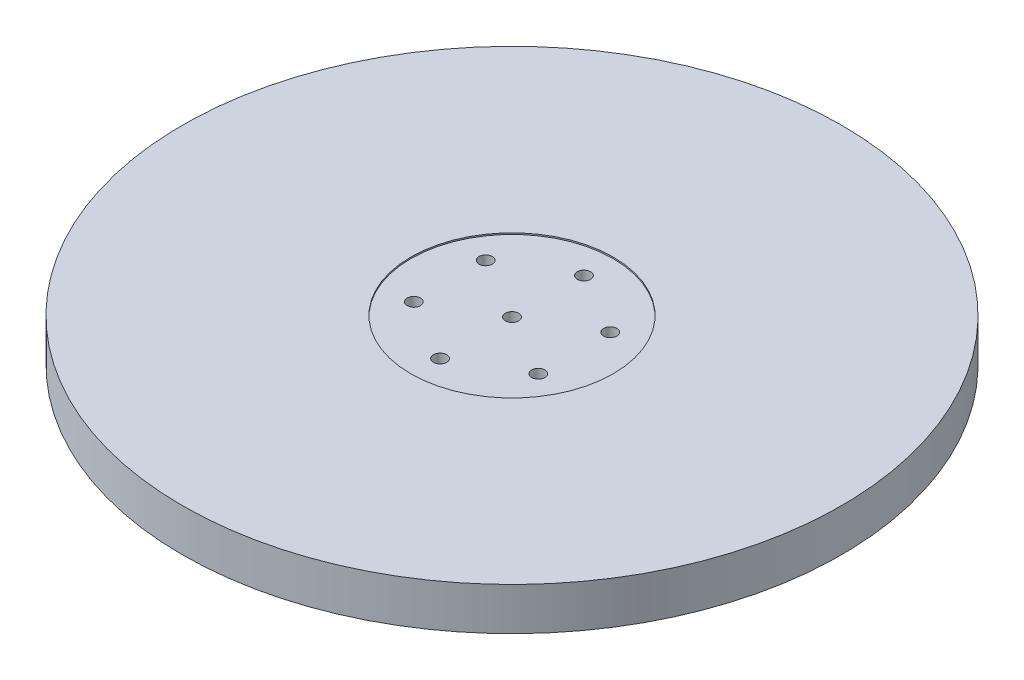
ISO-10303-21;
HEADER;
FILE_DESCRIPTION(('STEP AP214'),'2;1');
FILE_NAME('part.step','',(''),(''),'','','');
FILE_SCHEMA(('AUTOMOTIVE_DESIGN { 1 0 10303 214 1 1 1 1 }'));
ENDSEC;
DATA;
#1=APPLICATION_CONTEXT('core data for automotive mechanical design processes');
#2=APPLICATION_PROTOCOL_DEFINITION('international standard','automotive_design',2000,#1);
#3=PRODUCT_CONTEXT('',#1,'mechanical');
#4=PRODUCT('Part','Part','',(#3));
#5=PRODUCT_RELATED_PRODUCT_CATEGORY('part','',(#4));
#6=PRODUCT_DEFINITION_FORMATION('','',#4);
#7=PRODUCT_DEFINITION_CONTEXT('part definition',#1,'design');
#8=PRODUCT_DEFINITION('design','',#6,#7);
#9=PRODUCT_DEFINITION_SHAPE('','',#8);
#10=(LENGTH_UNIT() NAMED_UNIT(*) SI_UNIT(.MILLI.,.METRE.));
#11=(NAMED_UNIT(*) PLANE_ANGLE_UNIT() SI_UNIT($,.RADIAN.));
#12=(NAMED_UNIT(*) SI_UNIT($,.STERADIAN.) SOLID_ANGLE_UNIT());
#13=UNCERTAINTY_MEASURE_WITH_UNIT(LENGTH_MEASURE(1.E-05),#10,'distance_accuracy_value','');
#14=(GEOMETRIC_REPRESENTATION_CONTEXT(3) GLOBAL_UNCERTAINTY_ASSIGNED_CONTEXT((#13)) GLOBAL_UNIT_ASSIGNED_CONTEXT((#10,
#11,#12)) REPRESENTATION_CONTEXT('',''));
#15=CARTESIAN_POINT('',(0.,0.,0.));
#16=DIRECTION('',(0.,0.,1.));
#17=DIRECTION('',(1.,0.,0.));
#18=AXIS2_PLACEMENT_3D('',#15,#16,#17);
#19=CARTESIAN_POINT('',(11.6913429510903,4.,-6.75000000000069));
#20=DIRECTION('',(0.,1.,0.));
#21=DIRECTION('',(0.,0.,1.));
#22=AXIS2_PLACEMENT_3D('',#19,#20,#21);
#23=CYLINDRICAL_SURFACE('',#22,1.25);
#24=CARTESIAN_POINT('',(11.6913429510903,4.,-6.75000000000069));
#25=DIRECTION('',(0.,1.,0.));
#26=DIRECTION('',(0.,0.,1.));
#27=AXIS2_PLACEMENT_3D('',#24,#25,#26);
#28=CIRCLE('',#27,1.25);
#29=CARTESIAN_POINT('',(11.6913429510903,4.,-5.50000000000069));
#30=VERTEX_POINT('',#29);
#31=EDGE_CURVE('E65',#30,#30,#28,.T.);
#32=ORIENTED_EDGE('',*,*,#31,.F.);
#33=EDGE_LOOP('',(#32));
#34=FACE_BOUND('',#33,.T.);
#35=CARTESIAN_POINT('',(11.6913429510903,7.7361,-6.75000000000069));
#36=DIRECTION('',(0.,1.,0.));
#37=DIRECTION('',(0.,0.,1.));
#38=AXIS2_PLACEMENT_3D('',#35,#36,#37);
#39=CIRCLE('',#38,1.25);
#40=CARTESIAN_POINT('',(11.6913429510903,7.7361,-5.50000000000069));
#41=VERTEX_POINT('',#40);
#42=EDGE_CURVE('E97',#41,#41,#39,.F.);
#43=ORIENTED_EDGE('',*,*,#42,.F.);
#44=EDGE_LOOP('',(#43));
#45=FACE_BOUND('',#44,.T.);
#46=ADVANCED_FACE('F41',(#34,#45),#23,.F.);
#47=CARTESIAN_POINT('',(0.,4.,-13.5));
#48=DIRECTION('',(0.,1.,0.));
#49=DIRECTION('',(0.,0.,1.));
#50=AXIS2_PLACEMENT_3D('',#47,#48,#49);
#51=CYLINDRICAL_SURFACE('',#50,1.25);
#52=CARTESIAN_POINT('',(0.,4.,-13.5));
#53=DIRECTION('',(0.,1.,0.));
#54=DIRECTION('',(0.,0.,1.));
#55=AXIS2_PLACEMENT_3D('',#52,#53,#54);
#56=CIRCLE('',#55,1.25);
#57=CARTESIAN_POINT('',(0.,4.,-12.25));
#58=VERTEX_POINT('',#57);
#59=EDGE_CURVE('E69',#58,#58,#56,.T.);
#60=ORIENTED_EDGE('',*,*,#59,.F.);
#61=EDGE_LOOP('',(#60));
#62=FACE_BOUND('',#61,.T.);
#63=CARTESIAN_POINT('',(0.,7.7361,-13.5));
#64=DIRECTION('',(0.,1.,0.));
#65=DIRECTION('',(0.,0.,1.));
#66=AXIS2_PLACEMENT_3D('',#63,#64,#65);
#67=CIRCLE('',#66,1.25);
#68=CARTESIAN_POINT('',(0.,7.7361,-12.25));
#69=VERTEX_POINT('',#68);
#70=EDGE_CURVE('E101',#69,#69,#67,.F.);
#71=ORIENTED_EDGE('',*,*,#70,.F.);
#72=EDGE_LOOP('',(#71));
#73=FACE_BOUND('',#72,.T.);
#74=ADVANCED_FACE('F152',(#62,#73),#51,.F.);
#75=CARTESIAN_POINT('',(-11.6913429510895,4.,-6.74999999999931));
#76=DIRECTION('',(0.,1.,0.));
#77=DIRECTION('',(0.,0.,1.));
#78=AXIS2_PLACEMENT_3D('',#75,#76,#77);
#79=CYLINDRICAL_SURFACE('',#78,1.25);
#80=CARTESIAN_POINT('',(-11.6913429510895,4.,-6.74999999999931));
#81=DIRECTION('',(0.,1.,0.));
#82=DIRECTION('',(0.,0.,1.));
#83=AXIS2_PLACEMENT_3D('',#80,#81,#82);
#84=CIRCLE('',#83,1.25);
#85=CARTESIAN_POINT('',(-11.6913429510895,4.,-5.49999999999931));
#86=VERTEX_POINT('',#85);
#87=EDGE_CURVE('E83',#86,#86,#84,.T.);
#88=ORIENTED_EDGE('',*,*,#87,.F.);
#89=EDGE_LOOP('',(#88));
#90=FACE_BOUND('',#89,.T.);
#91=CARTESIAN_POINT('',(-11.6913429510895,7.7361,-6.74999999999931));
#92=DIRECTION('',(0.,1.,0.));
#93=DIRECTION('',(0.,0.,1.));
#94=AXIS2_PLACEMENT_3D('',#91,#92,#93);
#95=CIRCLE('',#94,1.25);
#96=CARTESIAN_POINT('',(-11.6913429510895,7.7361,-5.49999999999931));
#97=VERTEX_POINT('',#96);
#98=EDGE_CURVE('E105',#97,#97,#95,.F.);
#99=ORIENTED_EDGE('',*,*,#98,.F.);
#100=EDGE_LOOP('',(#99));
#101=FACE_BOUND('',#100,.T.);
#102=ADVANCED_FACE('F159',(#90,#101),#79,.F.);
#103=CARTESIAN_POINT('',(-11.6913429510887,4.,6.75000000000069));
#104=DIRECTION('',(0.,1.,0.));
#105=DIRECTION('',(0.,0.,1.));
#106=AXIS2_PLACEMENT_3D('',#103,#104,#105);
#107=CYLINDRICAL_SURFACE('',#106,1.25);
#108=CARTESIAN_POINT('',(-11.6913429510887,4.,6.75000000000069));
#109=DIRECTION('',(0.,1.,0.));
#110=DIRECTION('',(0.,0.,1.));
#111=AXIS2_PLACEMENT_3D('',#108,#109,#110);
#112=CIRCLE('',#111,1.25);
#113=CARTESIAN_POINT('',(-11.6913429510887,4.,8.00000000000069));
#114=VERTEX_POINT('',#113);
#115=EDGE_CURVE('E79',#114,#114,#112,.T.);
#116=ORIENTED_EDGE('',*,*,#115,.F.);
#117=EDGE_LOOP('',(#116));
#118=FACE_BOUND('',#117,.T.);
#119=CARTESIAN_POINT('',(-11.6913429510887,7.7361,6.75000000000069));
#120=DIRECTION('',(0.,1.,0.));
#121=DIRECTION('',(0.,0.,1.));
#122=AXIS2_PLACEMENT_3D('',#119,#120,#121);
#123=CIRCLE('',#122,1.25);
#124=CARTESIAN_POINT('',(-11.6913429510887,7.7361,8.00000000000069));
#125=VERTEX_POINT('',#124);
#126=EDGE_CURVE('E109',#125,#125,#123,.F.);
#127=ORIENTED_EDGE('',*,*,#126,.F.);
#128=EDGE_LOOP('',(#127));
#129=FACE_BOUND('',#128,.T.);
#130=ADVANCED_FACE('F233',(#118,#129),#107,.F.);
#131=CARTESIAN_POINT('',(0.,4.,13.5));
#132=DIRECTION('',(0.,1.,0.));
#133=DIRECTION('',(0.,0.,1.));
#134=AXIS2_PLACEMENT_3D('',#131,#132,#133);
#135=CYLINDRICAL_SURFACE('',#134,1.25);
#136=CARTESIAN_POINT('',(0.,4.,13.5));
#137=DIRECTION('',(0.,1.,0.));
#138=DIRECTION('',(0.,0.,1.));
#139=AXIS2_PLACEMENT_3D('',#136,#137,#138);
#140=CIRCLE('',#139,1.25);
#141=CARTESIAN_POINT('',(0.,4.,14.75));
#142=VERTEX_POINT('',#141);
#143=EDGE_CURVE('E74',#142,#142,#140,.T.);
#144=ORIENTED_EDGE('',*,*,#143,.F.);
#145=EDGE_LOOP('',(#144));
#146=FACE_BOUND('',#145,.T.);
#147=CARTESIAN_POINT('',(0.,7.7361,13.5));
#148=DIRECTION('',(0.,1.,0.));
#149=DIRECTION('',(0.,0.,1.));
#150=AXIS2_PLACEMENT_3D('',#147,#148,#149);
#151=CIRCLE('',#150,1.25);
#152=CARTESIAN_POINT('',(0.,7.7361,14.75));
#153=VERTEX_POINT('',#152);
#154=EDGE_CURVE('E113',#153,#153,#151,.F.);
#155=ORIENTED_EDGE('',*,*,#154,.F.);
#156=EDGE_LOOP('',(#155));
#157=FACE_BOUND('',#156,.T.);
#158=ADVANCED_FACE('F145',(#146,#157),#135,.F.);
#159=CARTESIAN_POINT('',(11.6913429510911,4.,6.74999999999931));
#160=DIRECTION('',(0.,1.,0.));
#161=DIRECTION('',(0.,0.,1.));
#162=AXIS2_PLACEMENT_3D('',#159,#160,#161);
#163=CYLINDRICAL_SURFACE('',#162,1.25);
#164=CARTESIAN_POINT('',(11.6913429510911,4.,6.74999999999931));
#165=DIRECTION('',(0.,1.,0.));
#166=DIRECTION('',(0.,0.,1.));
#167=AXIS2_PLACEMENT_3D('',#164,#165,#166);
#168=CIRCLE('',#167,1.25);
#169=CARTESIAN_POINT('',(11.6913429510911,4.,7.99999999999931));
#170=VERTEX_POINT('',#169);
#171=EDGE_CURVE('E70',#170,#170,#168,.T.);
#172=ORIENTED_EDGE('',*,*,#171,.F.);
#173=EDGE_LOOP('',(#172));
#174=FACE_BOUND('',#173,.T.);
#175=CARTESIAN_POINT('',(11.6913429510911,7.7361,6.74999999999931));
#176=DIRECTION('',(0.,1.,0.));
#177=DIRECTION('',(0.,0.,1.));
#178=AXIS2_PLACEMENT_3D('',#175,#176,#177);
#179=CIRCLE('',#178,1.25);
#180=CARTESIAN_POINT('',(11.6913429510911,7.7361,7.99999999999931));
#181=VERTEX_POINT('',#180);
#182=EDGE_CURVE('E117',#181,#181,#179,.F.);
#183=ORIENTED_EDGE('',*,*,#182,.F.);
#184=EDGE_LOOP('',(#183));
#185=FACE_BOUND('',#184,.T.);
#186=ADVANCED_FACE('F136',(#174,#185),#163,.F.);
#187=CARTESIAN_POINT('',(0.,4.,0.));
#188=DIRECTION('',(0.,1.,0.));
#189=DIRECTION('',(0.,0.,1.));
#190=AXIS2_PLACEMENT_3D('',#187,#188,#189);
#191=CYLINDRICAL_SURFACE('',#190,1.25);
#192=CARTESIAN_POINT('',(0.,4.,0.));
#193=DIRECTION('',(0.,1.,0.));
#194=DIRECTION('',(0.,0.,1.));
#195=AXIS2_PLACEMENT_3D('',#192,#193,#194);
#196=CIRCLE('',#195,1.25);
#197=CARTESIAN_POINT('',(0.,4.,1.25));
#198=VERTEX_POINT('',#197);
#199=EDGE_CURVE('E75',#198,#198,#196,.T.);
#200=ORIENTED_EDGE('',*,*,#199,.F.);
#201=EDGE_LOOP('',(#200));
#202=FACE_BOUND('',#201,.T.);
#203=CARTESIAN_POINT('',(0.,7.7361,0.));
#204=DIRECTION('',(0.,1.,0.));
#205=DIRECTION('',(0.,0.,1.));
#206=AXIS2_PLACEMENT_3D('',#203,#204,#205);
#207=CIRCLE('',#206,1.25);
#208=CARTESIAN_POINT('',(0.,7.7361,1.25));
#209=VERTEX_POINT('',#208);
#210=EDGE_CURVE('E45',#209,#209,#207,.F.);
#211=ORIENTED_EDGE('',*,*,#210,.F.);
#212=EDGE_LOOP('',(#211));
#213=FACE_BOUND('',#212,.T.);
#214=ADVANCED_FACE('F133',(#202,#213),#191,.F.);
#215=CARTESIAN_POINT('',(0.,0.,0.));
#216=DIRECTION('',(0.,1.,0.));
#217=DIRECTION('',(0.,0.,1.));
#218=AXIS2_PLACEMENT_3D('',#215,#216,#217);
#219=CYLINDRICAL_SURFACE('',#218,20.);
#220=CARTESIAN_POINT('',(0.,0.,0.));
#221=DIRECTION('',(0.,1.,0.));
#222=DIRECTION('',(0.,0.,1.));
#223=AXIS2_PLACEMENT_3D('',#220,#221,#222);
#224=CIRCLE('',#223,20.);
#225=CARTESIAN_POINT('',(0.,0.,20.));
#226=VERTEX_POINT('',#225);
#227=EDGE_CURVE('E60',#226,#226,#224,.T.);
#228=ORIENTED_EDGE('',*,*,#227,.F.);
#229=EDGE_LOOP('',(#228));
#230=FACE_BOUND('',#229,.T.);
#231=CARTESIAN_POINT('',(0.,4.,0.));
#232=DIRECTION('',(0.,1.,0.));
#233=DIRECTION('',(0.,0.,1.));
#234=AXIS2_PLACEMENT_3D('',#231,#232,#233);
#235=CIRCLE('',#234,20.);
#236=CARTESIAN_POINT('',(0.,4.,20.));
#237=VERTEX_POINT('',#236);
#238=EDGE_CURVE('E10',#237,#237,#235,.F.);
#239=ORIENTED_EDGE('',*,*,#238,.F.);
#240=EDGE_LOOP('',(#239));
#241=FACE_BOUND('',#240,.T.);
#242=ADVANCED_FACE('F135',(#230,#241),#219,.F.);
#243=CARTESIAN_POINT('',(0.,8.,0.));
#244=DIRECTION('',(0.,-1.,0.));
#245=DIRECTION('',(0.,0.,-1.));
#246=AXIS2_PLACEMENT_3D('',#243,#244,#245);
#247=CYLINDRICAL_SURFACE('',#246,61.885645);
#248=CARTESIAN_POINT('',(0.,8.,0.));
#249=DIRECTION('',(0.,1.,0.));
#250=DIRECTION('',(0.,0.,1.));
#251=AXIS2_PLACEMENT_3D('',#248,#249,#250);
#252=CIRCLE('',#251,61.885645);
#253=CARTESIAN_POINT('',(0.,8.,61.885645));
#254=VERTEX_POINT('',#253);
#255=EDGE_CURVE('E50',#254,#254,#252,.T.);
#256=ORIENTED_EDGE('',*,*,#255,.F.);
#257=EDGE_LOOP('',(#256));
#258=FACE_BOUND('',#257,.T.);
#259=CARTESIAN_POINT('',(0.,0.,0.));
#260=DIRECTION('',(0.,1.,0.));
#261=DIRECTION('',(0.,0.,1.));
#262=AXIS2_PLACEMENT_3D('',#259,#260,#261);
#263=CIRCLE('',#262,61.885645);
#264=CARTESIAN_POINT('',(0.,0.,61.885645));
#265=VERTEX_POINT('',#264);
#266=EDGE_CURVE('E55',#265,#265,#263,.T.);
#267=ORIENTED_EDGE('',*,*,#266,.T.);
#268=EDGE_LOOP('',(#267));
#269=FACE_BOUND('',#268,.T.);
#270=ADVANCED_FACE('F43',(#258,#269),#247,.T.);
#271=CARTESIAN_POINT('',(0.,8.,0.));
#272=DIRECTION('',(0.,1.,0.));
#273=DIRECTION('',(0.,0.,1.));
#274=AXIS2_PLACEMENT_3D('',#271,#272,#273);
#275=PLANE('',#274);
#276=CARTESIAN_POINT('',(0.,8.,0.));
#277=DIRECTION('',(0.,1.,0.));
#278=DIRECTION('',(0.,0.,1.));
#279=AXIS2_PLACEMENT_3D('',#276,#277,#278);
#280=CIRCLE('',#279,19.);
#281=CARTESIAN_POINT('',(0.,8.,19.));
#282=VERTEX_POINT('',#281);
#283=EDGE_CURVE('E93',#282,#282,#280,.T.);
#284=ORIENTED_EDGE('',*,*,#283,.F.);
#285=EDGE_LOOP('',(#284));
#286=FACE_BOUND('',#285,.T.);
#287=ORIENTED_EDGE('',*,*,#255,.T.);
#288=EDGE_LOOP('',(#287));
#289=FACE_BOUND('',#288,.T.);
#290=ADVANCED_FACE('F170',(#286,#289),#275,.T.);
#291=CARTESIAN_POINT('',(0.,0.,0.));
#292=DIRECTION('',(0.,1.,0.));
#293=DIRECTION('',(0.,0.,1.));
#294=AXIS2_PLACEMENT_3D('',#291,#292,#293);
#295=PLANE('',#294);
#296=ORIENTED_EDGE('',*,*,#227,.T.);
#297=EDGE_LOOP('',(#296));
#298=FACE_BOUND('',#297,.T.);
#299=ORIENTED_EDGE('',*,*,#266,.F.);
#300=EDGE_LOOP('',(#299));
#301=FACE_BOUND('',#300,.T.);
#302=ADVANCED_FACE('F167',(#298,#301),#295,.F.);
#303=CARTESIAN_POINT('',(0.,4.,0.));
#304=DIRECTION('',(0.,1.,0.));
#305=DIRECTION('',(0.,0.,1.));
#306=AXIS2_PLACEMENT_3D('',#303,#304,#305);
#307=PLANE('',#306);
#308=ORIENTED_EDGE('',*,*,#199,.T.);
#309=EDGE_LOOP('',(#308));
#310=FACE_BOUND('',#309,.T.);
#311=ORIENTED_EDGE('',*,*,#171,.T.);
#312=EDGE_LOOP('',(#311));
#313=FACE_BOUND('',#312,.T.);
#314=ORIENTED_EDGE('',*,*,#143,.T.);
#315=EDGE_LOOP('',(#314));
#316=FACE_BOUND('',#315,.T.);
#317=ORIENTED_EDGE('',*,*,#115,.T.);
#318=EDGE_LOOP('',(#317));
#319=FACE_BOUND('',#318,.T.);
#320=ORIENTED_EDGE('',*,*,#87,.T.);
#321=EDGE_LOOP('',(#320));
#322=FACE_BOUND('',#321,.T.);
#323=ORIENTED_EDGE('',*,*,#59,.T.);
#324=EDGE_LOOP('',(#323));
#325=FACE_BOUND('',#324,.T.);
#326=ORIENTED_EDGE('',*,*,#31,.T.);
#327=EDGE_LOOP('',(#326));
#328=FACE_BOUND('',#327,.T.);
#329=ORIENTED_EDGE('',*,*,#238,.T.);
#330=EDGE_LOOP('',(#329));
#331=FACE_BOUND('',#330,.T.);
#332=ADVANCED_FACE('F165',(#310,#313,#316,#319,#322,#325,#328,#331),#307,.F.);
#333=CARTESIAN_POINT('',(0.,7.7361,0.));
#334=DIRECTION('',(0.,1.,0.));
#335=DIRECTION('',(0.,0.,1.));
#336=AXIS2_PLACEMENT_3D('',#333,#334,#335);
#337=PLANE('',#336);
#338=CARTESIAN_POINT('',(0.,7.7361,0.));
#339=DIRECTION('',(0.,1.,0.));
#340=DIRECTION('',(0.,0.,1.));
#341=AXIS2_PLACEMENT_3D('',#338,#339,#340);
#342=CIRCLE('',#341,19.);
#343=CARTESIAN_POINT('',(0.,7.7361,19.));
#344=VERTEX_POINT('',#343);
#345=EDGE_CURVE('E121',#344,#344,#342,.T.);
#346=ORIENTED_EDGE('',*,*,#345,.T.);
#347=EDGE_LOOP('',(#346));
#348=FACE_BOUND('',#347,.T.);
#349=ORIENTED_EDGE('',*,*,#210,.T.);
#350=EDGE_LOOP('',(#349));
#351=FACE_BOUND('',#350,.T.);
#352=ORIENTED_EDGE('',*,*,#182,.T.);
#353=EDGE_LOOP('',(#352));
#354=FACE_BOUND('',#353,.T.);
#355=ORIENTED_EDGE('',*,*,#154,.T.);
#356=EDGE_LOOP('',(#355));
#357=FACE_BOUND('',#356,.T.);
#358=ORIENTED_EDGE('',*,*,#126,.T.);
#359=EDGE_LOOP('',(#358));
#360=FACE_BOUND('',#359,.T.);
#361=ORIENTED_EDGE('',*,*,#98,.T.);
#362=EDGE_LOOP('',(#361));
#363=FACE_BOUND('',#362,.T.);
#364=ORIENTED_EDGE('',*,*,#70,.T.);
#365=EDGE_LOOP('',(#364));
#366=FACE_BOUND('',#365,.T.);
#367=ORIENTED_EDGE('',*,*,#42,.T.);
#368=EDGE_LOOP('',(#367));
#369=FACE_BOUND('',#368,.T.);
#370=ADVANCED_FACE('F130',(#348,#351,#354,#357,#360,#363,#366,#369),#337,.T.);
#371=CARTESIAN_POINT('',(0.,7.7361,0.));
#372=DIRECTION('',(0.,1.,0.));
#373=DIRECTION('',(0.,0.,1.));
#374=AXIS2_PLACEMENT_3D('',#371,#372,#373);
#375=CYLINDRICAL_SURFACE('',#374,19.);
#376=ORIENTED_EDGE('',*,*,#283,.T.);
#377=EDGE_LOOP('',(#376));
#378=FACE_BOUND('',#377,.T.);
#379=ORIENTED_EDGE('',*,*,#345,.F.);
#380=EDGE_LOOP('',(#379));
#381=FACE_BOUND('',#380,.T.);
#382=ADVANCED_FACE('F275',(#378,#381),#375,.F.);
#383=CLOSED_SHELL('',(#46,#74,#102,#130,#158,#186,#214,#242,#270,#290,#302,#332,#370,#382));
#384=MANIFOLD_SOLID_BREP('B2',#383);
#385=ADVANCED_BREP_SHAPE_REPRESENTATION('',(#18,#384),#14);
#386=SHAPE_DEFINITION_REPRESENTATION(#9,#385);
ENDSEC;
END-ISO-10303-21;
